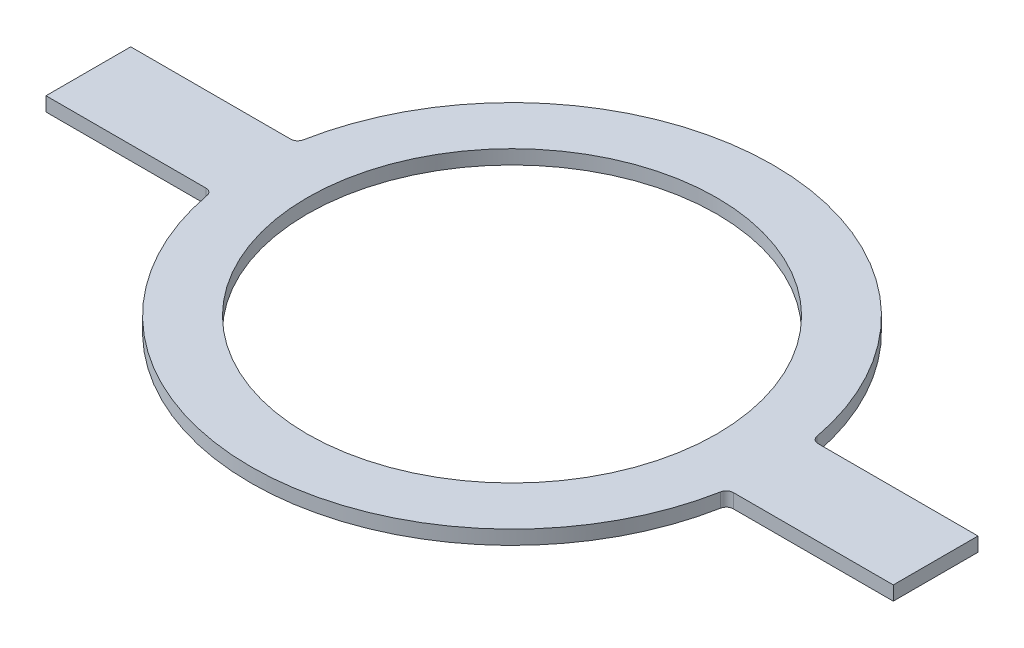
ISO-10303-21;
HEADER;
FILE_DESCRIPTION(('STEP AP214'),'2;1');
FILE_NAME('part.step','',(''),(''),'','','');
FILE_SCHEMA(('AUTOMOTIVE_DESIGN { 1 0 10303 214 1 1 1 1 }'));
ENDSEC;
DATA;
#1=APPLICATION_CONTEXT('core data for automotive mechanical design processes');
#2=APPLICATION_PROTOCOL_DEFINITION('international standard','automotive_design',2000,#1);
#3=PRODUCT_CONTEXT('',#1,'mechanical');
#4=PRODUCT('Part','Part','',(#3));
#5=PRODUCT_RELATED_PRODUCT_CATEGORY('part','',(#4));
#6=PRODUCT_DEFINITION_FORMATION('','',#4);
#7=PRODUCT_DEFINITION_CONTEXT('part definition',#1,'design');
#8=PRODUCT_DEFINITION('design','',#6,#7);
#9=PRODUCT_DEFINITION_SHAPE('','',#8);
#10=(LENGTH_UNIT() NAMED_UNIT(*) SI_UNIT(.MILLI.,.METRE.));
#11=(NAMED_UNIT(*) PLANE_ANGLE_UNIT() SI_UNIT($,.RADIAN.));
#12=(NAMED_UNIT(*) SI_UNIT($,.STERADIAN.) SOLID_ANGLE_UNIT());
#13=UNCERTAINTY_MEASURE_WITH_UNIT(LENGTH_MEASURE(1.E-05),#10,'distance_accuracy_value','');
#14=(GEOMETRIC_REPRESENTATION_CONTEXT(3) GLOBAL_UNCERTAINTY_ASSIGNED_CONTEXT((#13)) GLOBAL_UNIT_ASSIGNED_CONTEXT((#10,
#11,#12)) REPRESENTATION_CONTEXT('',''));
#15=CARTESIAN_POINT('',(0.,0.,0.));
#16=DIRECTION('',(0.,0.,1.));
#17=DIRECTION('',(1.,0.,0.));
#18=AXIS2_PLACEMENT_3D('',#15,#16,#17);
#19=CARTESIAN_POINT('',(0.,6.35,0.));
#20=DIRECTION('',(0.,1.,0.));
#21=DIRECTION('',(0.,0.,1.));
#22=AXIS2_PLACEMENT_3D('',#19,#20,#21);
#23=PLANE('',#22);
#24=CARTESIAN_POINT('',(0.,6.35,0.));
#25=DIRECTION('',(0.,1.,0.));
#26=DIRECTION('',(0.,0.,1.));
#27=AXIS2_PLACEMENT_3D('',#24,#25,#26);
#28=CIRCLE('',#27,117.475);
#29=CARTESIAN_POINT('',(-115.464628047926,6.35,21.6401315789474));
#30=VERTEX_POINT('',#29);
#31=CARTESIAN_POINT('',(115.464628047926,6.35,21.6401315789474));
#32=VERTEX_POINT('',#31);
#33=EDGE_CURVE('E263',#30,#32,#28,.T.);
#34=ORIENTED_EDGE('',*,*,#33,.T.);
#35=CARTESIAN_POINT('',(118.585293670843,6.35,22.225));
#36=DIRECTION('',(0.,1.,0.));
#37=DIRECTION('',(0.,0.,1.));
#38=AXIS2_PLACEMENT_3D('',#35,#36,#37);
#39=CIRCLE('',#38,3.175);
#40=CARTESIAN_POINT('',(118.585293670843,6.35,19.05));
#41=VERTEX_POINT('',#40);
#42=EDGE_CURVE('E128',#32,#41,#39,.F.);
#43=ORIENTED_EDGE('',*,*,#42,.T.);
#44=DIRECTION('',(1.,0.,0.));
#45=VECTOR('',#44,1.);
#46=CARTESIAN_POINT('',(115.920115273407,6.35,19.05));
#47=LINE('',#46,#45);
#48=CARTESIAN_POINT('',(190.5,6.35,19.05));
#49=VERTEX_POINT('',#48);
#50=EDGE_CURVE('E120',#41,#49,#47,.T.);
#51=ORIENTED_EDGE('',*,*,#50,.T.);
#52=DIRECTION('',(0.,0.,-1.));
#53=VECTOR('',#52,1.);
#54=CARTESIAN_POINT('',(190.5,6.35,-19.05));
#55=LINE('',#54,#53);
#56=CARTESIAN_POINT('',(190.5,6.35,-19.05));
#57=VERTEX_POINT('',#56);
#58=EDGE_CURVE('E125',#49,#57,#55,.T.);
#59=ORIENTED_EDGE('',*,*,#58,.T.);
#60=DIRECTION('',(-1.,0.,0.));
#61=VECTOR('',#60,1.);
#62=CARTESIAN_POINT('',(115.920115273407,6.35,-19.05));
#63=LINE('',#62,#61);
#64=CARTESIAN_POINT('',(118.585293670843,6.35,-19.05));
#65=VERTEX_POINT('',#64);
#66=EDGE_CURVE('E142',#57,#65,#63,.T.);
#67=ORIENTED_EDGE('',*,*,#66,.T.);
#68=CARTESIAN_POINT('',(118.585293670843,6.35,-22.225));
#69=DIRECTION('',(0.,1.,0.));
#70=DIRECTION('',(0.,0.,1.));
#71=AXIS2_PLACEMENT_3D('',#68,#69,#70);
#72=CIRCLE('',#71,3.175);
#73=CARTESIAN_POINT('',(115.464628047926,6.35,-21.6401315789474));
#74=VERTEX_POINT('',#73);
#75=EDGE_CURVE('E177',#65,#74,#72,.F.);
#76=ORIENTED_EDGE('',*,*,#75,.T.);
#77=CARTESIAN_POINT('',(0.,6.35,0.));
#78=DIRECTION('',(0.,1.,0.));
#79=DIRECTION('',(0.,0.,1.));
#80=AXIS2_PLACEMENT_3D('',#77,#78,#79);
#81=CIRCLE('',#80,117.475);
#82=CARTESIAN_POINT('',(-115.464628047926,6.35,-21.6401315789474));
#83=VERTEX_POINT('',#82);
#84=EDGE_CURVE('E251',#74,#83,#81,.T.);
#85=ORIENTED_EDGE('',*,*,#84,.T.);
#86=CARTESIAN_POINT('',(-118.585293670843,6.35,-22.225));
#87=DIRECTION('',(0.,1.,0.));
#88=DIRECTION('',(0.,0.,1.));
#89=AXIS2_PLACEMENT_3D('',#86,#87,#88);
#90=CIRCLE('',#89,3.175);
#91=CARTESIAN_POINT('',(-118.585293670843,6.35,-19.05));
#92=VERTEX_POINT('',#91);
#93=EDGE_CURVE('E173',#83,#92,#90,.F.);
#94=ORIENTED_EDGE('',*,*,#93,.T.);
#95=DIRECTION('',(-1.,0.,0.));
#96=VECTOR('',#95,1.);
#97=CARTESIAN_POINT('',(-190.5,6.35,-19.05));
#98=LINE('',#97,#96);
#99=CARTESIAN_POINT('',(-190.5,6.35,-19.05));
#100=VERTEX_POINT('',#99);
#101=EDGE_CURVE('E248',#92,#100,#98,.T.);
#102=ORIENTED_EDGE('',*,*,#101,.T.);
#103=DIRECTION('',(0.,0.,1.));
#104=VECTOR('',#103,1.);
#105=CARTESIAN_POINT('',(-190.5,6.35,-19.05));
#106=LINE('',#105,#104);
#107=CARTESIAN_POINT('',(-190.5,6.35,19.05));
#108=VERTEX_POINT('',#107);
#109=EDGE_CURVE('E255',#100,#108,#106,.T.);
#110=ORIENTED_EDGE('',*,*,#109,.T.);
#111=DIRECTION('',(1.,0.,0.));
#112=VECTOR('',#111,1.);
#113=CARTESIAN_POINT('',(-190.5,6.35,19.05));
#114=LINE('',#113,#112);
#115=CARTESIAN_POINT('',(-118.585293670843,6.35,19.05));
#116=VERTEX_POINT('',#115);
#117=EDGE_CURVE('E257',#108,#116,#114,.T.);
#118=ORIENTED_EDGE('',*,*,#117,.T.);
#119=CARTESIAN_POINT('',(-118.585293670843,6.35,22.225));
#120=DIRECTION('',(0.,1.,0.));
#121=DIRECTION('',(0.,0.,1.));
#122=AXIS2_PLACEMENT_3D('',#119,#120,#121);
#123=CIRCLE('',#122,3.175);
#124=EDGE_CURVE('E11',#116,#30,#123,.F.);
#125=ORIENTED_EDGE('',*,*,#124,.T.);
#126=EDGE_LOOP('',(#34,#43,#51,#59,#67,#76,#85,#94,#102,#110,#118,#125));
#127=FACE_BOUND('',#126,.T.);
#128=CARTESIAN_POINT('',(0.,6.35,0.));
#129=DIRECTION('',(0.,1.,0.));
#130=DIRECTION('',(0.,0.,1.));
#131=AXIS2_PLACEMENT_3D('',#128,#129,#130);
#132=CIRCLE('',#131,92.075);
#133=CARTESIAN_POINT('',(0.,6.35,92.075));
#134=VERTEX_POINT('',#133);
#135=EDGE_CURVE('E268',#134,#134,#132,.T.);
#136=ORIENTED_EDGE('',*,*,#135,.F.);
#137=EDGE_LOOP('',(#136));
#138=FACE_BOUND('',#137,.T.);
#139=ADVANCED_FACE('F32',(#127,#138),#23,.T.);
#140=CARTESIAN_POINT('',(0.,0.,0.));
#141=DIRECTION('',(0.,1.,0.));
#142=DIRECTION('',(0.,0.,1.));
#143=AXIS2_PLACEMENT_3D('',#140,#141,#142);
#144=PLANE('',#143);
#145=DIRECTION('',(1.,0.,0.));
#146=VECTOR('',#145,1.);
#147=CARTESIAN_POINT('',(115.920115273407,0.,19.05));
#148=LINE('',#147,#146);
#149=CARTESIAN_POINT('',(118.585293670843,0.,19.05));
#150=VERTEX_POINT('',#149);
#151=CARTESIAN_POINT('',(190.5,0.,19.05));
#152=VERTEX_POINT('',#151);
#153=EDGE_CURVE('E146',#150,#152,#148,.T.);
#154=ORIENTED_EDGE('',*,*,#153,.F.);
#155=CARTESIAN_POINT('',(118.585293670843,0.,22.225));
#156=DIRECTION('',(0.,1.,0.));
#157=DIRECTION('',(0.,0.,1.));
#158=AXIS2_PLACEMENT_3D('',#155,#156,#157);
#159=CIRCLE('',#158,3.175);
#160=CARTESIAN_POINT('',(115.464628047926,0.,21.6401315789474));
#161=VERTEX_POINT('',#160);
#162=EDGE_CURVE('E179',#150,#161,#159,.T.);
#163=ORIENTED_EDGE('',*,*,#162,.T.);
#164=CARTESIAN_POINT('',(0.,0.,0.));
#165=DIRECTION('',(0.,1.,0.));
#166=DIRECTION('',(0.,0.,1.));
#167=AXIS2_PLACEMENT_3D('',#164,#165,#166);
#168=CIRCLE('',#167,117.475);
#169=CARTESIAN_POINT('',(-115.464628047926,0.,21.6401315789474));
#170=VERTEX_POINT('',#169);
#171=EDGE_CURVE('E133',#170,#161,#168,.T.);
#172=ORIENTED_EDGE('',*,*,#171,.F.);
#173=CARTESIAN_POINT('',(-118.585293670843,0.,22.225));
#174=DIRECTION('',(0.,1.,0.));
#175=DIRECTION('',(0.,0.,1.));
#176=AXIS2_PLACEMENT_3D('',#173,#174,#175);
#177=CIRCLE('',#176,3.175);
#178=CARTESIAN_POINT('',(-118.585293670843,0.,19.05));
#179=VERTEX_POINT('',#178);
#180=EDGE_CURVE('E40',#170,#179,#177,.T.);
#181=ORIENTED_EDGE('',*,*,#180,.T.);
#182=DIRECTION('',(1.,0.,0.));
#183=VECTOR('',#182,1.);
#184=CARTESIAN_POINT('',(-190.5,0.,19.05));
#185=LINE('',#184,#183);
#186=CARTESIAN_POINT('',(-190.5,0.,19.05));
#187=VERTEX_POINT('',#186);
#188=EDGE_CURVE('E190',#187,#179,#185,.T.);
#189=ORIENTED_EDGE('',*,*,#188,.F.);
#190=DIRECTION('',(0.,0.,1.));
#191=VECTOR('',#190,1.);
#192=CARTESIAN_POINT('',(-190.5,0.,-19.05));
#193=LINE('',#192,#191);
#194=CARTESIAN_POINT('',(-190.5,0.,-19.05));
#195=VERTEX_POINT('',#194);
#196=EDGE_CURVE('E278',#195,#187,#193,.T.);
#197=ORIENTED_EDGE('',*,*,#196,.F.);
#198=DIRECTION('',(-1.,0.,0.));
#199=VECTOR('',#198,1.);
#200=CARTESIAN_POINT('',(-190.5,0.,-19.05));
#201=LINE('',#200,#199);
#202=CARTESIAN_POINT('',(-118.585293670843,0.,-19.05));
#203=VERTEX_POINT('',#202);
#204=EDGE_CURVE('E276',#203,#195,#201,.T.);
#205=ORIENTED_EDGE('',*,*,#204,.F.);
#206=CARTESIAN_POINT('',(-118.585293670843,0.,-22.225));
#207=DIRECTION('',(0.,1.,0.));
#208=DIRECTION('',(0.,0.,1.));
#209=AXIS2_PLACEMENT_3D('',#206,#207,#208);
#210=CIRCLE('',#209,3.175);
#211=CARTESIAN_POINT('',(-115.464628047926,0.,-21.6401315789474));
#212=VERTEX_POINT('',#211);
#213=EDGE_CURVE('E171',#203,#212,#210,.T.);
#214=ORIENTED_EDGE('',*,*,#213,.T.);
#215=CARTESIAN_POINT('',(0.,0.,0.));
#216=DIRECTION('',(0.,1.,0.));
#217=DIRECTION('',(0.,0.,1.));
#218=AXIS2_PLACEMENT_3D('',#215,#216,#217);
#219=CIRCLE('',#218,117.475);
#220=CARTESIAN_POINT('',(115.464628047926,0.,-21.6401315789474));
#221=VERTEX_POINT('',#220);
#222=EDGE_CURVE('E273',#221,#212,#219,.T.);
#223=ORIENTED_EDGE('',*,*,#222,.F.);
#224=CARTESIAN_POINT('',(118.585293670843,0.,-22.225));
#225=DIRECTION('',(0.,1.,0.));
#226=DIRECTION('',(0.,0.,1.));
#227=AXIS2_PLACEMENT_3D('',#224,#225,#226);
#228=CIRCLE('',#227,3.175);
#229=CARTESIAN_POINT('',(118.585293670843,0.,-19.05));
#230=VERTEX_POINT('',#229);
#231=EDGE_CURVE('E175',#221,#230,#228,.T.);
#232=ORIENTED_EDGE('',*,*,#231,.T.);
#233=DIRECTION('',(-1.,0.,0.));
#234=VECTOR('',#233,1.);
#235=CARTESIAN_POINT('',(115.920115273407,0.,-19.05));
#236=LINE('',#235,#234);
#237=CARTESIAN_POINT('',(190.5,0.,-19.05));
#238=VERTEX_POINT('',#237);
#239=EDGE_CURVE('E270',#238,#230,#236,.T.);
#240=ORIENTED_EDGE('',*,*,#239,.F.);
#241=DIRECTION('',(0.,0.,-1.));
#242=VECTOR('',#241,1.);
#243=CARTESIAN_POINT('',(190.5,0.,-19.05));
#244=LINE('',#243,#242);
#245=EDGE_CURVE('E267',#152,#238,#244,.T.);
#246=ORIENTED_EDGE('',*,*,#245,.F.);
#247=EDGE_LOOP('',(#154,#163,#172,#181,#189,#197,#205,#214,#223,#232,#240,#246));
#248=FACE_BOUND('',#247,.T.);
#249=CARTESIAN_POINT('',(0.,0.,0.));
#250=DIRECTION('',(0.,1.,0.));
#251=DIRECTION('',(0.,0.,1.));
#252=AXIS2_PLACEMENT_3D('',#249,#250,#251);
#253=CIRCLE('',#252,92.075);
#254=CARTESIAN_POINT('',(0.,0.,92.075));
#255=VERTEX_POINT('',#254);
#256=EDGE_CURVE('E291',#255,#255,#253,.T.);
#257=ORIENTED_EDGE('',*,*,#256,.T.);
#258=EDGE_LOOP('',(#257));
#259=FACE_BOUND('',#258,.T.);
#260=ADVANCED_FACE('F182',(#248,#259),#144,.F.);
#261=CARTESIAN_POINT('',(115.920115273407,6.35,19.05));
#262=DIRECTION('',(0.,0.,-1.));
#263=DIRECTION('',(-1.,0.,0.));
#264=AXIS2_PLACEMENT_3D('',#261,#262,#263);
#265=PLANE('',#264);
#266=ORIENTED_EDGE('',*,*,#50,.F.);
#267=DIRECTION('',(0.,1.,0.));
#268=VECTOR('',#267,1.);
#269=CARTESIAN_POINT('',(118.585293670843,0.,19.05));
#270=LINE('',#269,#268);
#271=EDGE_CURVE('E163',#41,#150,#270,.F.);
#272=ORIENTED_EDGE('',*,*,#271,.T.);
#273=ORIENTED_EDGE('',*,*,#153,.T.);
#274=DIRECTION('',(0.,-1.,0.));
#275=VECTOR('',#274,1.);
#276=CARTESIAN_POINT('',(190.5,6.35,19.05));
#277=LINE('',#276,#275);
#278=EDGE_CURVE('E138',#49,#152,#277,.T.);
#279=ORIENTED_EDGE('',*,*,#278,.F.);
#280=EDGE_LOOP('',(#266,#272,#273,#279));
#281=FACE_BOUND('',#280,.T.);
#282=ADVANCED_FACE('F144',(#281),#265,.F.);
#283=CARTESIAN_POINT('',(190.5,6.35,-19.05));
#284=DIRECTION('',(-1.,0.,0.));
#285=DIRECTION('',(0.,0.,1.));
#286=AXIS2_PLACEMENT_3D('',#283,#284,#285);
#287=PLANE('',#286);
#288=ORIENTED_EDGE('',*,*,#245,.T.);
#289=DIRECTION('',(0.,-1.,0.));
#290=VECTOR('',#289,1.);
#291=CARTESIAN_POINT('',(190.5,6.35,-19.05));
#292=LINE('',#291,#290);
#293=EDGE_CURVE('E140',#57,#238,#292,.T.);
#294=ORIENTED_EDGE('',*,*,#293,.F.);
#295=ORIENTED_EDGE('',*,*,#58,.F.);
#296=ORIENTED_EDGE('',*,*,#278,.T.);
#297=EDGE_LOOP('',(#288,#294,#295,#296));
#298=FACE_BOUND('',#297,.T.);
#299=ADVANCED_FACE('F137',(#298),#287,.F.);
#300=CARTESIAN_POINT('',(115.920115273407,6.35,-19.05));
#301=DIRECTION('',(0.,0.,1.));
#302=DIRECTION('',(1.,0.,0.));
#303=AXIS2_PLACEMENT_3D('',#300,#301,#302);
#304=PLANE('',#303);
#305=ORIENTED_EDGE('',*,*,#239,.T.);
#306=DIRECTION('',(0.,1.,0.));
#307=VECTOR('',#306,1.);
#308=CARTESIAN_POINT('',(118.585293670843,6.35,-19.05));
#309=LINE('',#308,#307);
#310=EDGE_CURVE('E161',#230,#65,#309,.T.);
#311=ORIENTED_EDGE('',*,*,#310,.T.);
#312=ORIENTED_EDGE('',*,*,#66,.F.);
#313=ORIENTED_EDGE('',*,*,#293,.T.);
#314=EDGE_LOOP('',(#305,#311,#312,#313));
#315=FACE_BOUND('',#314,.T.);
#316=ADVANCED_FACE('F228',(#315),#304,.F.);
#317=CARTESIAN_POINT('',(0.,6.35,0.));
#318=DIRECTION('',(0.,-1.,0.));
#319=DIRECTION('',(0.,0.,-1.));
#320=AXIS2_PLACEMENT_3D('',#317,#318,#319);
#321=CYLINDRICAL_SURFACE('',#320,117.475);
#322=ORIENTED_EDGE('',*,*,#222,.T.);
#323=DIRECTION('',(0.,-1.,0.));
#324=VECTOR('',#323,1.);
#325=CARTESIAN_POINT('',(-115.464628047926,6.35,-21.6401315789474));
#326=LINE('',#325,#324);
#327=EDGE_CURVE('E159',#212,#83,#326,.F.);
#328=ORIENTED_EDGE('',*,*,#327,.T.);
#329=ORIENTED_EDGE('',*,*,#84,.F.);
#330=DIRECTION('',(0.,-1.,0.));
#331=VECTOR('',#330,1.);
#332=CARTESIAN_POINT('',(115.464628047926,6.35,-21.6401315789474));
#333=LINE('',#332,#331);
#334=EDGE_CURVE('E151',#74,#221,#333,.T.);
#335=ORIENTED_EDGE('',*,*,#334,.T.);
#336=EDGE_LOOP('',(#322,#328,#329,#335));
#337=FACE_BOUND('',#336,.T.);
#338=ADVANCED_FACE('F224',(#337),#321,.T.);
#339=CARTESIAN_POINT('',(-190.5,6.35,-19.05));
#340=DIRECTION('',(0.,0.,1.));
#341=DIRECTION('',(1.,0.,0.));
#342=AXIS2_PLACEMENT_3D('',#339,#340,#341);
#343=PLANE('',#342);
#344=ORIENTED_EDGE('',*,*,#101,.F.);
#345=DIRECTION('',(0.,1.,0.));
#346=VECTOR('',#345,1.);
#347=CARTESIAN_POINT('',(-118.585293670843,0.,-19.05));
#348=LINE('',#347,#346);
#349=EDGE_CURVE('E148',#92,#203,#348,.F.);
#350=ORIENTED_EDGE('',*,*,#349,.T.);
#351=ORIENTED_EDGE('',*,*,#204,.T.);
#352=DIRECTION('',(0.,-1.,0.));
#353=VECTOR('',#352,1.);
#354=CARTESIAN_POINT('',(-190.5,6.35,-19.05));
#355=LINE('',#354,#353);
#356=EDGE_CURVE('E153',#100,#195,#355,.T.);
#357=ORIENTED_EDGE('',*,*,#356,.F.);
#358=EDGE_LOOP('',(#344,#350,#351,#357));
#359=FACE_BOUND('',#358,.T.);
#360=ADVANCED_FACE('F220',(#359),#343,.F.);
#361=CARTESIAN_POINT('',(-190.5,6.35,-19.05));
#362=DIRECTION('',(1.,0.,0.));
#363=DIRECTION('',(0.,0.,-1.));
#364=AXIS2_PLACEMENT_3D('',#361,#362,#363);
#365=PLANE('',#364);
#366=ORIENTED_EDGE('',*,*,#196,.T.);
#367=DIRECTION('',(0.,-1.,0.));
#368=VECTOR('',#367,1.);
#369=CARTESIAN_POINT('',(-190.5,6.35,19.05));
#370=LINE('',#369,#368);
#371=EDGE_CURVE('E265',#108,#187,#370,.T.);
#372=ORIENTED_EDGE('',*,*,#371,.F.);
#373=ORIENTED_EDGE('',*,*,#109,.F.);
#374=ORIENTED_EDGE('',*,*,#356,.T.);
#375=EDGE_LOOP('',(#366,#372,#373,#374));
#376=FACE_BOUND('',#375,.T.);
#377=ADVANCED_FACE('F217',(#376),#365,.F.);
#378=CARTESIAN_POINT('',(-190.5,6.35,19.05));
#379=DIRECTION('',(0.,0.,-1.));
#380=DIRECTION('',(-1.,0.,0.));
#381=AXIS2_PLACEMENT_3D('',#378,#379,#380);
#382=PLANE('',#381);
#383=ORIENTED_EDGE('',*,*,#188,.T.);
#384=DIRECTION('',(0.,1.,0.));
#385=VECTOR('',#384,1.);
#386=CARTESIAN_POINT('',(-118.585293670843,6.35,19.05));
#387=LINE('',#386,#385);
#388=EDGE_CURVE('E47',#179,#116,#387,.T.);
#389=ORIENTED_EDGE('',*,*,#388,.T.);
#390=ORIENTED_EDGE('',*,*,#117,.F.);
#391=ORIENTED_EDGE('',*,*,#371,.T.);
#392=EDGE_LOOP('',(#383,#389,#390,#391));
#393=FACE_BOUND('',#392,.T.);
#394=ADVANCED_FACE('F214',(#393),#382,.F.);
#395=CARTESIAN_POINT('',(0.,6.35,0.));
#396=DIRECTION('',(0.,-1.,0.));
#397=DIRECTION('',(0.,0.,-1.));
#398=AXIS2_PLACEMENT_3D('',#395,#396,#397);
#399=CYLINDRICAL_SURFACE('',#398,117.475);
#400=ORIENTED_EDGE('',*,*,#171,.T.);
#401=DIRECTION('',(0.,-1.,0.));
#402=VECTOR('',#401,1.);
#403=CARTESIAN_POINT('',(115.464628047926,6.35,21.6401315789474));
#404=LINE('',#403,#402);
#405=EDGE_CURVE('E168',#161,#32,#404,.F.);
#406=ORIENTED_EDGE('',*,*,#405,.T.);
#407=ORIENTED_EDGE('',*,*,#33,.F.);
#408=DIRECTION('',(0.,-1.,0.));
#409=VECTOR('',#408,1.);
#410=CARTESIAN_POINT('',(-115.464628047926,6.35,21.6401315789474));
#411=LINE('',#410,#409);
#412=EDGE_CURVE('E165',#30,#170,#411,.T.);
#413=ORIENTED_EDGE('',*,*,#412,.T.);
#414=EDGE_LOOP('',(#400,#406,#407,#413));
#415=FACE_BOUND('',#414,.T.);
#416=ADVANCED_FACE('F187',(#415),#399,.T.);
#417=CARTESIAN_POINT('',(0.,6.35,0.));
#418=DIRECTION('',(0.,-1.,0.));
#419=DIRECTION('',(0.,0.,-1.));
#420=AXIS2_PLACEMENT_3D('',#417,#418,#419);
#421=CYLINDRICAL_SURFACE('',#420,92.075);
#422=ORIENTED_EDGE('',*,*,#135,.T.);
#423=EDGE_LOOP('',(#422));
#424=FACE_BOUND('',#423,.T.);
#425=ORIENTED_EDGE('',*,*,#256,.F.);
#426=EDGE_LOOP('',(#425));
#427=FACE_BOUND('',#426,.T.);
#428=ADVANCED_FACE('F210',(#424,#427),#421,.F.);
#429=CARTESIAN_POINT('',(-118.585293670843,6.35,-22.225));
#430=DIRECTION('',(0.,-1.,0.));
#431=DIRECTION('',(0.,0.,-1.));
#432=AXIS2_PLACEMENT_3D('',#429,#430,#431);
#433=CYLINDRICAL_SURFACE('',#432,3.175);
#434=ORIENTED_EDGE('',*,*,#93,.F.);
#435=ORIENTED_EDGE('',*,*,#327,.F.);
#436=ORIENTED_EDGE('',*,*,#213,.F.);
#437=ORIENTED_EDGE('',*,*,#349,.F.);
#438=EDGE_LOOP('',(#434,#435,#436,#437));
#439=FACE_BOUND('',#438,.T.);
#440=ADVANCED_FACE('F200',(#439),#433,.F.);
#441=CARTESIAN_POINT('',(118.585293670843,6.35,-22.225));
#442=DIRECTION('',(0.,-1.,0.));
#443=DIRECTION('',(0.,0.,-1.));
#444=AXIS2_PLACEMENT_3D('',#441,#442,#443);
#445=CYLINDRICAL_SURFACE('',#444,3.175);
#446=ORIENTED_EDGE('',*,*,#75,.F.);
#447=ORIENTED_EDGE('',*,*,#310,.F.);
#448=ORIENTED_EDGE('',*,*,#231,.F.);
#449=ORIENTED_EDGE('',*,*,#334,.F.);
#450=EDGE_LOOP('',(#446,#447,#448,#449));
#451=FACE_BOUND('',#450,.T.);
#452=ADVANCED_FACE('F194',(#451),#445,.F.);
#453=CARTESIAN_POINT('',(118.585293670843,6.35,22.225));
#454=DIRECTION('',(0.,-1.,0.));
#455=DIRECTION('',(0.,0.,-1.));
#456=AXIS2_PLACEMENT_3D('',#453,#454,#455);
#457=CYLINDRICAL_SURFACE('',#456,3.175);
#458=ORIENTED_EDGE('',*,*,#42,.F.);
#459=ORIENTED_EDGE('',*,*,#405,.F.);
#460=ORIENTED_EDGE('',*,*,#162,.F.);
#461=ORIENTED_EDGE('',*,*,#271,.F.);
#462=EDGE_LOOP('',(#458,#459,#460,#461));
#463=FACE_BOUND('',#462,.T.);
#464=ADVANCED_FACE('F192',(#463),#457,.F.);
#465=CARTESIAN_POINT('',(-118.585293670843,6.35,22.225));
#466=DIRECTION('',(0.,-1.,0.));
#467=DIRECTION('',(0.,0.,-1.));
#468=AXIS2_PLACEMENT_3D('',#465,#466,#467);
#469=CYLINDRICAL_SURFACE('',#468,3.175);
#470=ORIENTED_EDGE('',*,*,#124,.F.);
#471=ORIENTED_EDGE('',*,*,#388,.F.);
#472=ORIENTED_EDGE('',*,*,#180,.F.);
#473=ORIENTED_EDGE('',*,*,#412,.F.);
#474=EDGE_LOOP('',(#470,#471,#472,#473));
#475=FACE_BOUND('',#474,.T.);
#476=ADVANCED_FACE('F34',(#475),#469,.F.);
#477=CLOSED_SHELL('',(#139,#260,#282,#299,#316,#338,#360,#377,#394,#416,#428,#440,#452,#464,#476));
#478=MANIFOLD_SOLID_BREP('B2',#477);
#479=ADVANCED_BREP_SHAPE_REPRESENTATION('',(#18,#478),#14);
#480=SHAPE_DEFINITION_REPRESENTATION(#9,#479);
ENDSEC;
END-ISO-10303-21;
